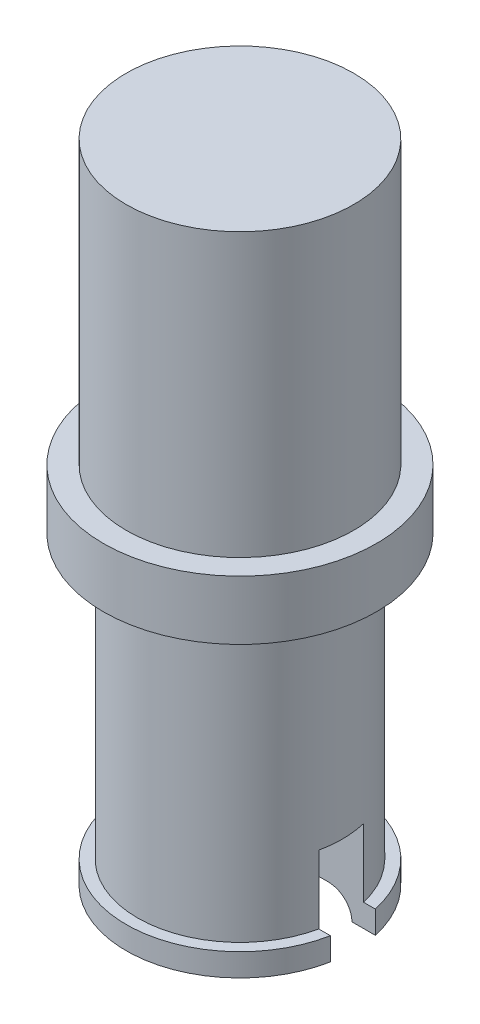
ISO-10303-21;
HEADER;
FILE_DESCRIPTION(('STEP AP214'),'2;1');
FILE_NAME('part.step','',(''),(''),'','','');
FILE_SCHEMA(('AUTOMOTIVE_DESIGN { 1 0 10303 214 1 1 1 1 }'));
ENDSEC;
DATA;
#1=APPLICATION_CONTEXT('core data for automotive mechanical design processes');
#2=APPLICATION_PROTOCOL_DEFINITION('international standard','automotive_design',2000,#1);
#3=PRODUCT_CONTEXT('',#1,'mechanical');
#4=PRODUCT('Part','Part','',(#3));
#5=PRODUCT_RELATED_PRODUCT_CATEGORY('part','',(#4));
#6=PRODUCT_DEFINITION_FORMATION('','',#4);
#7=PRODUCT_DEFINITION_CONTEXT('part definition',#1,'design');
#8=PRODUCT_DEFINITION('design','',#6,#7);
#9=PRODUCT_DEFINITION_SHAPE('','',#8);
#10=(LENGTH_UNIT() NAMED_UNIT(*) SI_UNIT(.MILLI.,.METRE.));
#11=(NAMED_UNIT(*) PLANE_ANGLE_UNIT() SI_UNIT($,.RADIAN.));
#12=(NAMED_UNIT(*) SI_UNIT($,.STERADIAN.) SOLID_ANGLE_UNIT());
#13=UNCERTAINTY_MEASURE_WITH_UNIT(LENGTH_MEASURE(1.E-05),#10,'distance_accuracy_value','');
#14=(GEOMETRIC_REPRESENTATION_CONTEXT(3) GLOBAL_UNCERTAINTY_ASSIGNED_CONTEXT((#13)) GLOBAL_UNIT_ASSIGNED_CONTEXT((#10,
#11,#12)) REPRESENTATION_CONTEXT('',''));
#15=CARTESIAN_POINT('',(0.,0.,0.));
#16=DIRECTION('',(0.,0.,1.));
#17=DIRECTION('',(1.,0.,0.));
#18=AXIS2_PLACEMENT_3D('',#15,#16,#17);
#19=CARTESIAN_POINT('',(0.,0.5,0.));
#20=DIRECTION('',(0.,1.,0.));
#21=DIRECTION('',(0.,0.,1.));
#22=AXIS2_PLACEMENT_3D('',#19,#20,#21);
#23=PLANE('',#22);
#24=DIRECTION('',(1.,0.,0.));
#25=VECTOR('',#24,1.);
#26=CARTESIAN_POINT('',(0.,0.5,0.468491026025954));
#27=LINE('',#26,#25);
#28=CARTESIAN_POINT('',(-2.45571092731477,0.5,0.468491026025954));
#29=VERTEX_POINT('',#28);
#30=CARTESIAN_POINT('',(-2.20068538381413,0.5,0.468491026025954));
#31=VERTEX_POINT('',#30);
#32=EDGE_CURVE('E186',#29,#31,#27,.T.);
#33=ORIENTED_EDGE('',*,*,#32,.F.);
#34=CARTESIAN_POINT('',(0.,0.5,0.));
#35=DIRECTION('',(0.,1.,0.));
#36=DIRECTION('',(0.,0.,1.));
#37=AXIS2_PLACEMENT_3D('',#34,#35,#36);
#38=CIRCLE('',#37,2.5);
#39=CARTESIAN_POINT('',(2.45571092731477,0.5,0.468491026025954));
#40=VERTEX_POINT('',#39);
#41=EDGE_CURVE('E228',#29,#40,#38,.T.);
#42=ORIENTED_EDGE('',*,*,#41,.T.);
#43=CARTESIAN_POINT('',(2.20068538381413,0.5,0.468491026025954));
#44=VERTEX_POINT('',#43);
#45=EDGE_CURVE('E181',#44,#40,#27,.T.);
#46=ORIENTED_EDGE('',*,*,#45,.F.);
#47=CARTESIAN_POINT('',(0.,0.5,0.));
#48=DIRECTION('',(0.,1.,0.));
#49=DIRECTION('',(0.,0.,1.));
#50=AXIS2_PLACEMENT_3D('',#47,#48,#49);
#51=CIRCLE('',#50,2.25);
#52=EDGE_CURVE('E180',#31,#44,#51,.T.);
#53=ORIENTED_EDGE('',*,*,#52,.F.);
#54=EDGE_LOOP('',(#33,#42,#46,#53));
#55=FACE_BOUND('',#54,.T.);
#56=ADVANCED_FACE('F35',(#55),#23,.T.);
#57=CARTESIAN_POINT('',(0.,0.,0.));
#58=DIRECTION('',(0.,1.,0.));
#59=DIRECTION('',(0.,0.,1.));
#60=AXIS2_PLACEMENT_3D('',#57,#58,#59);
#61=PLANE('',#60);
#62=CARTESIAN_POINT('',(0.,0.,0.));
#63=DIRECTION('',(0.,1.,0.));
#64=DIRECTION('',(0.,0.,1.));
#65=AXIS2_PLACEMENT_3D('',#62,#63,#64);
#66=CIRCLE('',#65,2.5);
#67=CARTESIAN_POINT('',(-2.45571092731477,0.,0.468491026025954));
#68=VERTEX_POINT('',#67);
#69=CARTESIAN_POINT('',(2.45571092731477,0.,0.468491026025954));
#70=VERTEX_POINT('',#69);
#71=EDGE_CURVE('E232',#68,#70,#66,.T.);
#72=ORIENTED_EDGE('',*,*,#71,.F.);
#73=DIRECTION('',(-1.,0.,0.));
#74=VECTOR('',#73,1.);
#75=CARTESIAN_POINT('',(-2.60754158019278,0.,0.468491026025954));
#76=LINE('',#75,#74);
#77=CARTESIAN_POINT('',(-1.9443549466425,0.,0.468491026025954));
#78=VERTEX_POINT('',#77);
#79=EDGE_CURVE('E331',#78,#68,#76,.T.);
#80=ORIENTED_EDGE('',*,*,#79,.F.);
#81=CARTESIAN_POINT('',(0.,0.,0.));
#82=DIRECTION('',(0.,1.,0.));
#83=DIRECTION('',(0.,0.,1.));
#84=AXIS2_PLACEMENT_3D('',#81,#82,#83);
#85=CIRCLE('',#84,2.);
#86=CARTESIAN_POINT('',(1.9443549466425,0.,0.468491026025954));
#87=VERTEX_POINT('',#86);
#88=EDGE_CURVE('E222',#78,#87,#85,.T.);
#89=ORIENTED_EDGE('',*,*,#88,.T.);
#90=EDGE_CURVE('E337',#70,#87,#76,.T.);
#91=ORIENTED_EDGE('',*,*,#90,.F.);
#92=EDGE_LOOP('',(#72,#80,#89,#91));
#93=FACE_BOUND('',#92,.T.);
#94=ADVANCED_FACE('F283',(#93),#61,.F.);
#95=CARTESIAN_POINT('',(0.,0.5,0.));
#96=DIRECTION('',(0.,-1.,0.));
#97=DIRECTION('',(0.,0.,-1.));
#98=AXIS2_PLACEMENT_3D('',#95,#96,#97);
#99=CYLINDRICAL_SURFACE('',#98,2.5);
#100=ORIENTED_EDGE('',*,*,#41,.F.);
#101=DIRECTION('',(0.,-1.,0.));
#102=VECTOR('',#101,1.);
#103=CARTESIAN_POINT('',(-2.45571092731477,0.5,0.468491026025954));
#104=LINE('',#103,#102);
#105=EDGE_CURVE('E195',#29,#68,#104,.T.);
#106=ORIENTED_EDGE('',*,*,#105,.T.);
#107=ORIENTED_EDGE('',*,*,#71,.T.);
#108=DIRECTION('',(0.,-1.,0.));
#109=VECTOR('',#108,1.);
#110=CARTESIAN_POINT('',(2.45571092731477,0.5,0.468491026025954));
#111=LINE('',#110,#109);
#112=EDGE_CURVE('E184',#70,#40,#111,.F.);
#113=ORIENTED_EDGE('',*,*,#112,.T.);
#114=EDGE_LOOP('',(#100,#106,#107,#113));
#115=FACE_BOUND('',#114,.T.);
#116=ADVANCED_FACE('F278',(#115),#99,.T.);
#117=CARTESIAN_POINT('',(0.,0.5,0.));
#118=DIRECTION('',(0.,1.,0.));
#119=DIRECTION('',(0.,0.,1.));
#120=AXIS2_PLACEMENT_3D('',#117,#118,#119);
#121=PLANE('',#120);
#122=DIRECTION('',(1.,0.,0.));
#123=VECTOR('',#122,1.);
#124=CARTESIAN_POINT('',(0.,0.5,0.468491026025954));
#125=LINE('',#124,#123);
#126=CARTESIAN_POINT('',(1.15888574006808,0.5,0.468491026025954));
#127=VERTEX_POINT('',#126);
#128=CARTESIAN_POINT('',(1.42496180949987,0.5,0.468491026025954));
#129=VERTEX_POINT('',#128);
#130=EDGE_CURVE('E187',#127,#129,#125,.T.);
#131=ORIENTED_EDGE('',*,*,#130,.T.);
#132=CARTESIAN_POINT('',(0.,0.5,0.));
#133=DIRECTION('',(0.,1.,0.));
#134=DIRECTION('',(0.,0.,1.));
#135=AXIS2_PLACEMENT_3D('',#132,#133,#134);
#136=CIRCLE('',#135,1.5);
#137=CARTESIAN_POINT('',(-1.42496180949987,0.5,0.468491026025954));
#138=VERTEX_POINT('',#137);
#139=EDGE_CURVE('E248',#129,#138,#136,.F.);
#140=ORIENTED_EDGE('',*,*,#139,.T.);
#141=CARTESIAN_POINT('',(-1.15888574006808,0.5,0.468491026025954));
#142=VERTEX_POINT('',#141);
#143=EDGE_CURVE('E182',#138,#142,#125,.T.);
#144=ORIENTED_EDGE('',*,*,#143,.T.);
#145=CARTESIAN_POINT('',(0.,0.5,0.));
#146=DIRECTION('',(0.,1.,0.));
#147=DIRECTION('',(0.,0.,1.));
#148=AXIS2_PLACEMENT_3D('',#145,#146,#147);
#149=CIRCLE('',#148,1.25);
#150=EDGE_CURVE('E215',#142,#127,#149,.T.);
#151=ORIENTED_EDGE('',*,*,#150,.T.);
#152=EDGE_LOOP('',(#131,#140,#144,#151));
#153=FACE_BOUND('',#152,.T.);
#154=ADVANCED_FACE('F286',(#153),#121,.F.);
#155=DIRECTION('',(-1.,0.,0.));
#156=VECTOR('',#155,1.);
#157=CARTESIAN_POINT('',(0.,0.5,-0.531508973974046));
#158=LINE('',#157,#156);
#159=CARTESIAN_POINT('',(2.44284633380511,0.5,-0.531508973974046));
#160=VERTEX_POINT('',#159);
#161=CARTESIAN_POINT('',(2.18632070167783,0.5,-0.531508973974046));
#162=VERTEX_POINT('',#161);
#163=EDGE_CURVE('E354',#160,#162,#158,.T.);
#164=ORIENTED_EDGE('',*,*,#163,.F.);
#165=CARTESIAN_POINT('',(-2.44284633380511,0.5,-0.531508973974047));
#166=VERTEX_POINT('',#165);
#167=EDGE_CURVE('E206',#160,#166,#38,.T.);
#168=ORIENTED_EDGE('',*,*,#167,.T.);
#169=CARTESIAN_POINT('',(-2.18632070167783,0.5,-0.531508973974046));
#170=VERTEX_POINT('',#169);
#171=EDGE_CURVE('E351',#170,#166,#158,.T.);
#172=ORIENTED_EDGE('',*,*,#171,.F.);
#173=EDGE_CURVE('E223',#162,#170,#51,.T.);
#174=ORIENTED_EDGE('',*,*,#173,.F.);
#175=EDGE_LOOP('',(#164,#168,#172,#174));
#176=FACE_BOUND('',#175,.T.);
#177=ADVANCED_FACE('F281',(#176),#23,.T.);
#178=CARTESIAN_POINT('',(2.44284633380511,0.,-0.531508973974046));
#179=VERTEX_POINT('',#178);
#180=CARTESIAN_POINT('',(-2.44284633380511,0.,-0.531508973974047));
#181=VERTEX_POINT('',#180);
#182=EDGE_CURVE('E231',#179,#181,#66,.T.);
#183=ORIENTED_EDGE('',*,*,#182,.F.);
#184=DIRECTION('',(1.,0.,0.));
#185=VECTOR('',#184,1.);
#186=CARTESIAN_POINT('',(-2.60754158019278,0.,-0.531508973974047));
#187=LINE('',#186,#185);
#188=CARTESIAN_POINT('',(1.92808148442566,0.,-0.531508973974046));
#189=VERTEX_POINT('',#188);
#190=EDGE_CURVE('E344',#189,#179,#187,.T.);
#191=ORIENTED_EDGE('',*,*,#190,.F.);
#192=CARTESIAN_POINT('',(-1.92808148442566,0.,-0.531508973974046));
#193=VERTEX_POINT('',#192);
#194=EDGE_CURVE('E227',#189,#193,#85,.T.);
#195=ORIENTED_EDGE('',*,*,#194,.T.);
#196=EDGE_CURVE('E338',#181,#193,#187,.T.);
#197=ORIENTED_EDGE('',*,*,#196,.F.);
#198=EDGE_LOOP('',(#183,#191,#195,#197));
#199=FACE_BOUND('',#198,.T.);
#200=ADVANCED_FACE('F276',(#199),#61,.F.);
#201=ORIENTED_EDGE('',*,*,#167,.F.);
#202=DIRECTION('',(0.,-1.,0.));
#203=VECTOR('',#202,1.);
#204=CARTESIAN_POINT('',(2.44284633380511,0.5,-0.531508973974046));
#205=LINE('',#204,#203);
#206=EDGE_CURVE('E358',#160,#179,#205,.T.);
#207=ORIENTED_EDGE('',*,*,#206,.T.);
#208=ORIENTED_EDGE('',*,*,#182,.T.);
#209=DIRECTION('',(0.,-1.,0.));
#210=VECTOR('',#209,1.);
#211=CARTESIAN_POINT('',(-2.44284633380511,0.5,-0.531508973974047));
#212=LINE('',#211,#210);
#213=EDGE_CURVE('E353',#181,#166,#212,.F.);
#214=ORIENTED_EDGE('',*,*,#213,.T.);
#215=EDGE_LOOP('',(#201,#207,#208,#214));
#216=FACE_BOUND('',#215,.T.);
#217=ADVANCED_FACE('F271',(#216),#99,.T.);
#218=DIRECTION('',(-1.,0.,0.));
#219=VECTOR('',#218,1.);
#220=CARTESIAN_POINT('',(0.,0.5,-0.531508973974046));
#221=LINE('',#220,#219);
#222=CARTESIAN_POINT('',(-1.13137005908105,0.5,-0.531508973974046));
#223=VERTEX_POINT('',#222);
#224=CARTESIAN_POINT('',(-1.40267537605287,0.5,-0.531508973974046));
#225=VERTEX_POINT('',#224);
#226=EDGE_CURVE('E162',#223,#225,#221,.T.);
#227=ORIENTED_EDGE('',*,*,#226,.T.);
#228=CARTESIAN_POINT('',(0.,0.5,0.));
#229=DIRECTION('',(0.,1.,0.));
#230=DIRECTION('',(0.,0.,1.));
#231=AXIS2_PLACEMENT_3D('',#228,#229,#230);
#232=CIRCLE('',#231,1.5);
#233=CARTESIAN_POINT('',(1.40267537605287,0.5,-0.531508973974046));
#234=VERTEX_POINT('',#233);
#235=EDGE_CURVE('E62',#225,#234,#232,.F.);
#236=ORIENTED_EDGE('',*,*,#235,.T.);
#237=CARTESIAN_POINT('',(1.13137005908105,0.5,-0.531508973974046));
#238=VERTEX_POINT('',#237);
#239=EDGE_CURVE('E347',#234,#238,#221,.T.);
#240=ORIENTED_EDGE('',*,*,#239,.T.);
#241=EDGE_CURVE('E218',#238,#223,#149,.T.);
#242=ORIENTED_EDGE('',*,*,#241,.T.);
#243=EDGE_LOOP('',(#227,#236,#240,#242));
#244=FACE_BOUND('',#243,.T.);
#245=ADVANCED_FACE('F275',(#244),#121,.F.);
#246=CARTESIAN_POINT('',(0.,6.7,0.));
#247=DIRECTION('',(0.,-1.,0.));
#248=DIRECTION('',(0.,0.,-1.));
#249=AXIS2_PLACEMENT_3D('',#246,#247,#248);
#250=CYLINDRICAL_SURFACE('',#249,2.25);
#251=ORIENTED_EDGE('',*,*,#52,.T.);
#252=DIRECTION('',(0.,-1.,0.));
#253=VECTOR('',#252,1.);
#254=CARTESIAN_POINT('',(2.20068538381413,6.7,0.468491026025954));
#255=LINE('',#254,#253);
#256=CARTESIAN_POINT('',(2.20068538381413,2.,0.468491026025954));
#257=VERTEX_POINT('',#256);
#258=EDGE_CURVE('E168',#44,#257,#255,.F.);
#259=ORIENTED_EDGE('',*,*,#258,.T.);
#260=CARTESIAN_POINT('',(0.,2.,0.));
#261=DIRECTION('',(0.,-1.,0.));
#262=DIRECTION('',(0.,0.,-1.));
#263=AXIS2_PLACEMENT_3D('',#260,#261,#262);
#264=CIRCLE('',#263,2.25);
#265=CARTESIAN_POINT('',(2.18632070167783,2.,-0.531508973974046));
#266=VERTEX_POINT('',#265);
#267=EDGE_CURVE('E152',#266,#257,#264,.T.);
#268=ORIENTED_EDGE('',*,*,#267,.F.);
#269=DIRECTION('',(0.,-1.,0.));
#270=VECTOR('',#269,1.);
#271=CARTESIAN_POINT('',(2.18632070167783,6.7,-0.531508973974046));
#272=LINE('',#271,#270);
#273=EDGE_CURVE('E357',#266,#162,#272,.T.);
#274=ORIENTED_EDGE('',*,*,#273,.T.);
#275=ORIENTED_EDGE('',*,*,#173,.T.);
#276=DIRECTION('',(0.,-1.,0.));
#277=VECTOR('',#276,1.);
#278=CARTESIAN_POINT('',(-2.18632070167783,6.7,-0.531508973974046));
#279=LINE('',#278,#277);
#280=CARTESIAN_POINT('',(-2.18632070167783,2.,-0.531508973974046));
#281=VERTEX_POINT('',#280);
#282=EDGE_CURVE('E348',#170,#281,#279,.F.);
#283=ORIENTED_EDGE('',*,*,#282,.T.);
#284=CARTESIAN_POINT('',(-2.20068538381413,2.,0.468491026025954));
#285=VERTEX_POINT('',#284);
#286=EDGE_CURVE('E163',#285,#281,#264,.T.);
#287=ORIENTED_EDGE('',*,*,#286,.F.);
#288=DIRECTION('',(0.,-1.,0.));
#289=VECTOR('',#288,1.);
#290=CARTESIAN_POINT('',(-2.20068538381413,6.7,0.468491026025954));
#291=LINE('',#290,#289);
#292=EDGE_CURVE('E193',#285,#31,#291,.T.);
#293=ORIENTED_EDGE('',*,*,#292,.T.);
#294=EDGE_LOOP('',(#251,#259,#268,#274,#275,#283,#287,#293));
#295=FACE_BOUND('',#294,.T.);
#296=CARTESIAN_POINT('',(0.,6.7,0.));
#297=DIRECTION('',(0.,1.,0.));
#298=DIRECTION('',(0.,0.,1.));
#299=AXIS2_PLACEMENT_3D('',#296,#297,#298);
#300=CIRCLE('',#299,2.25);
#301=CARTESIAN_POINT('',(0.,6.7,2.25));
#302=VERTEX_POINT('',#301);
#303=EDGE_CURVE('E219',#302,#302,#300,.T.);
#304=ORIENTED_EDGE('',*,*,#303,.F.);
#305=EDGE_LOOP('',(#304));
#306=FACE_BOUND('',#305,.T.);
#307=ADVANCED_FACE('F176',(#295,#306),#250,.T.);
#308=CARTESIAN_POINT('',(0.,6.7,0.));
#309=DIRECTION('',(0.,-1.,0.));
#310=DIRECTION('',(0.,0.,-1.));
#311=AXIS2_PLACEMENT_3D('',#308,#309,#310);
#312=CYLINDRICAL_SURFACE('',#311,1.25);
#313=DIRECTION('',(0.,-1.,0.));
#314=VECTOR('',#313,1.);
#315=CARTESIAN_POINT('',(1.15888574006808,6.7,0.468491026025954));
#316=LINE('',#315,#314);
#317=CARTESIAN_POINT('',(1.15888574006808,2.,0.468491026025954));
#318=VERTEX_POINT('',#317);
#319=EDGE_CURVE('E171',#127,#318,#316,.F.);
#320=ORIENTED_EDGE('',*,*,#319,.F.);
#321=ORIENTED_EDGE('',*,*,#150,.F.);
#322=DIRECTION('',(0.,-1.,0.));
#323=VECTOR('',#322,1.);
#324=CARTESIAN_POINT('',(-1.15888574006808,6.7,0.468491026025954));
#325=LINE('',#324,#323);
#326=CARTESIAN_POINT('',(-1.15888574006808,2.,0.468491026025954));
#327=VERTEX_POINT('',#326);
#328=EDGE_CURVE('E241',#327,#142,#325,.T.);
#329=ORIENTED_EDGE('',*,*,#328,.F.);
#330=CARTESIAN_POINT('',(0.,2.,0.));
#331=DIRECTION('',(0.,-1.,0.));
#332=DIRECTION('',(0.,0.,-1.));
#333=AXIS2_PLACEMENT_3D('',#330,#331,#332);
#334=CIRCLE('',#333,1.25);
#335=CARTESIAN_POINT('',(-1.13137005908105,2.,-0.531508973974046));
#336=VERTEX_POINT('',#335);
#337=EDGE_CURVE('E205',#327,#336,#334,.T.);
#338=ORIENTED_EDGE('',*,*,#337,.T.);
#339=DIRECTION('',(0.,-1.,0.));
#340=VECTOR('',#339,1.);
#341=CARTESIAN_POINT('',(-1.13137005908105,6.7,-0.531508973974046));
#342=LINE('',#341,#340);
#343=EDGE_CURVE('E237',#223,#336,#342,.F.);
#344=ORIENTED_EDGE('',*,*,#343,.F.);
#345=ORIENTED_EDGE('',*,*,#241,.F.);
#346=DIRECTION('',(0.,-1.,0.));
#347=VECTOR('',#346,1.);
#348=CARTESIAN_POINT('',(1.13137005908105,6.7,-0.531508973974046));
#349=LINE('',#348,#347);
#350=CARTESIAN_POINT('',(1.13137005908105,2.,-0.531508973974046));
#351=VERTEX_POINT('',#350);
#352=EDGE_CURVE('E244',#351,#238,#349,.T.);
#353=ORIENTED_EDGE('',*,*,#352,.F.);
#354=EDGE_CURVE('E238',#351,#318,#334,.T.);
#355=ORIENTED_EDGE('',*,*,#354,.T.);
#356=EDGE_LOOP('',(#320,#321,#329,#338,#344,#345,#353,#355));
#357=FACE_BOUND('',#356,.T.);
#358=CARTESIAN_POINT('',(0.,6.7,0.));
#359=DIRECTION('',(0.,1.,0.));
#360=DIRECTION('',(0.,0.,1.));
#361=AXIS2_PLACEMENT_3D('',#358,#359,#360);
#362=CIRCLE('',#361,1.25);
#363=CARTESIAN_POINT('',(0.,6.7,1.25));
#364=VERTEX_POINT('',#363);
#365=EDGE_CURVE('E210',#364,#364,#362,.T.);
#366=ORIENTED_EDGE('',*,*,#365,.T.);
#367=EDGE_LOOP('',(#366));
#368=FACE_BOUND('',#367,.T.);
#369=ADVANCED_FACE('F290',(#357,#368),#312,.F.);
#370=CARTESIAN_POINT('',(0.,6.7,0.));
#371=DIRECTION('',(0.,1.,0.));
#372=DIRECTION('',(0.,0.,1.));
#373=AXIS2_PLACEMENT_3D('',#370,#371,#372);
#374=PLANE('',#373);
#375=ORIENTED_EDGE('',*,*,#365,.F.);
#376=EDGE_LOOP('',(#375));
#377=FACE_BOUND('',#376,.T.);
#378=ADVANCED_FACE('F295',(#377),#374,.F.);
#379=CARTESIAN_POINT('',(0.,8.,0.));
#380=DIRECTION('',(0.,-1.,0.));
#381=DIRECTION('',(0.,0.,-1.));
#382=AXIS2_PLACEMENT_3D('',#379,#380,#381);
#383=CYLINDRICAL_SURFACE('',#382,3.);
#384=CARTESIAN_POINT('',(0.,8.,0.));
#385=DIRECTION('',(0.,1.,0.));
#386=DIRECTION('',(0.,0.,1.));
#387=AXIS2_PLACEMENT_3D('',#384,#385,#386);
#388=CIRCLE('',#387,3.);
#389=CARTESIAN_POINT('',(0.,8.,3.));
#390=VERTEX_POINT('',#389);
#391=EDGE_CURVE('E207',#390,#390,#388,.T.);
#392=ORIENTED_EDGE('',*,*,#391,.F.);
#393=EDGE_LOOP('',(#392));
#394=FACE_BOUND('',#393,.T.);
#395=CARTESIAN_POINT('',(0.,6.7,0.));
#396=DIRECTION('',(0.,1.,0.));
#397=DIRECTION('',(0.,0.,1.));
#398=AXIS2_PLACEMENT_3D('',#395,#396,#397);
#399=CIRCLE('',#398,3.);
#400=CARTESIAN_POINT('',(0.,6.7,3.));
#401=VERTEX_POINT('',#400);
#402=EDGE_CURVE('E201',#401,#401,#399,.T.);
#403=ORIENTED_EDGE('',*,*,#402,.T.);
#404=EDGE_LOOP('',(#403));
#405=FACE_BOUND('',#404,.T.);
#406=ADVANCED_FACE('F297',(#394,#405),#383,.T.);
#407=CARTESIAN_POINT('',(0.,8.,0.));
#408=DIRECTION('',(0.,1.,0.));
#409=DIRECTION('',(0.,0.,1.));
#410=AXIS2_PLACEMENT_3D('',#407,#408,#409);
#411=PLANE('',#410);
#412=CARTESIAN_POINT('',(0.,8.,0.));
#413=DIRECTION('',(0.,1.,0.));
#414=DIRECTION('',(0.,0.,1.));
#415=AXIS2_PLACEMENT_3D('',#412,#413,#414);
#416=CIRCLE('',#415,2.5);
#417=CARTESIAN_POINT('',(0.,8.,-2.5));
#418=VERTEX_POINT('',#417);
#419=EDGE_CURVE('E202',#418,#418,#416,.T.);
#420=ORIENTED_EDGE('',*,*,#419,.F.);
#421=EDGE_LOOP('',(#420));
#422=FACE_BOUND('',#421,.T.);
#423=ORIENTED_EDGE('',*,*,#391,.T.);
#424=EDGE_LOOP('',(#423));
#425=FACE_BOUND('',#424,.T.);
#426=ADVANCED_FACE('F300',(#422,#425),#411,.T.);
#427=ORIENTED_EDGE('',*,*,#303,.T.);
#428=EDGE_LOOP('',(#427));
#429=FACE_BOUND('',#428,.T.);
#430=ORIENTED_EDGE('',*,*,#402,.F.);
#431=EDGE_LOOP('',(#430));
#432=FACE_BOUND('',#431,.T.);
#433=ADVANCED_FACE('F302',(#429,#432),#374,.F.);
#434=CARTESIAN_POINT('',(0.,14.2,0.));
#435=DIRECTION('',(0.,-1.,0.));
#436=DIRECTION('',(0.,0.,-1.));
#437=AXIS2_PLACEMENT_3D('',#434,#435,#436);
#438=CYLINDRICAL_SURFACE('',#437,2.5);
#439=CARTESIAN_POINT('',(0.,14.2,0.));
#440=DIRECTION('',(0.,1.,0.));
#441=DIRECTION('',(0.,0.,1.));
#442=AXIS2_PLACEMENT_3D('',#439,#440,#441);
#443=CIRCLE('',#442,2.5);
#444=CARTESIAN_POINT('',(0.,14.2,-2.5));
#445=VERTEX_POINT('',#444);
#446=EDGE_CURVE('E198',#445,#445,#443,.T.);
#447=CARTESIAN_POINT('',(0.,14.2,-2.5));
#448=CARTESIAN_POINT('',(0.,14.1354166666667,-2.5));
#449=CARTESIAN_POINT('',(0.,14.0708333333333,-2.5));
#450=CARTESIAN_POINT('',(0.,13.9416666666667,-2.5));
#451=CARTESIAN_POINT('',(0.,13.8770833333333,-2.5));
#452=CARTESIAN_POINT('',(0.,13.7479166666667,-2.5));
#453=CARTESIAN_POINT('',(0.,13.6833333333333,-2.5));
#454=CARTESIAN_POINT('',(0.,13.5541666666667,-2.5));
#455=CARTESIAN_POINT('',(0.,13.4895833333333,-2.5));
#456=CARTESIAN_POINT('',(0.,13.3604166666667,-2.5));
#457=CARTESIAN_POINT('',(0.,13.2958333333333,-2.5));
#458=CARTESIAN_POINT('',(0.,13.1666666666667,-2.5));
#459=CARTESIAN_POINT('',(0.,13.1020833333333,-2.5));
#460=CARTESIAN_POINT('',(0.,12.9729166666667,-2.5));
#461=CARTESIAN_POINT('',(0.,12.9083333333333,-2.5));
#462=CARTESIAN_POINT('',(0.,12.7791666666667,-2.5));
#463=CARTESIAN_POINT('',(0.,12.7145833333333,-2.5));
#464=CARTESIAN_POINT('',(0.,12.5854166666667,-2.5));
#465=CARTESIAN_POINT('',(0.,12.5208333333333,-2.5));
#466=CARTESIAN_POINT('',(0.,12.3916666666667,-2.5));
#467=CARTESIAN_POINT('',(0.,12.3270833333333,-2.5));
#468=CARTESIAN_POINT('',(0.,12.1979166666667,-2.5));
#469=CARTESIAN_POINT('',(0.,12.1333333333333,-2.5));
#470=CARTESIAN_POINT('',(0.,12.0041666666667,-2.5));
#471=CARTESIAN_POINT('',(0.,11.9395833333333,-2.5));
#472=CARTESIAN_POINT('',(0.,11.8104166666667,-2.5));
#473=CARTESIAN_POINT('',(0.,11.7458333333333,-2.5));
#474=CARTESIAN_POINT('',(0.,11.6166666666667,-2.5));
#475=CARTESIAN_POINT('',(0.,11.5520833333333,-2.5));
#476=CARTESIAN_POINT('',(0.,11.4229166666667,-2.5));
#477=CARTESIAN_POINT('',(0.,11.3583333333333,-2.5));
#478=CARTESIAN_POINT('',(0.,11.2291666666667,-2.5));
#479=CARTESIAN_POINT('',(0.,11.1645833333333,-2.5));
#480=CARTESIAN_POINT('',(0.,11.0354166666667,-2.5));
#481=CARTESIAN_POINT('',(0.,10.9708333333333,-2.5));
#482=CARTESIAN_POINT('',(0.,10.8416666666667,-2.5));
#483=CARTESIAN_POINT('',(0.,10.7770833333333,-2.5));
#484=CARTESIAN_POINT('',(0.,10.6479166666667,-2.5));
#485=CARTESIAN_POINT('',(0.,10.5833333333333,-2.5));
#486=CARTESIAN_POINT('',(0.,10.4541666666667,-2.5));
#487=CARTESIAN_POINT('',(0.,10.3895833333333,-2.5));
#488=CARTESIAN_POINT('',(0.,10.2604166666667,-2.5));
#489=CARTESIAN_POINT('',(0.,10.1958333333333,-2.5));
#490=CARTESIAN_POINT('',(0.,10.0666666666667,-2.5));
#491=CARTESIAN_POINT('',(0.,10.0020833333333,-2.5));
#492=CARTESIAN_POINT('',(0.,9.87291666666667,-2.5));
#493=CARTESIAN_POINT('',(0.,9.80833333333333,-2.5));
#494=CARTESIAN_POINT('',(0.,9.67916666666667,-2.5));
#495=CARTESIAN_POINT('',(0.,9.61458333333333,-2.5));
#496=CARTESIAN_POINT('',(0.,9.48541666666667,-2.5));
#497=CARTESIAN_POINT('',(0.,9.42083333333333,-2.5));
#498=CARTESIAN_POINT('',(0.,9.29166666666667,-2.5));
#499=CARTESIAN_POINT('',(0.,9.22708333333333,-2.5));
#500=CARTESIAN_POINT('',(0.,9.09791666666667,-2.5));
#501=CARTESIAN_POINT('',(0.,9.03333333333333,-2.5));
#502=CARTESIAN_POINT('',(0.,8.90416666666667,-2.5));
#503=CARTESIAN_POINT('',(0.,8.83958333333333,-2.5));
#504=CARTESIAN_POINT('',(0.,8.71041666666667,-2.5));
#505=CARTESIAN_POINT('',(0.,8.64583333333333,-2.5));
#506=CARTESIAN_POINT('',(0.,8.51666666666667,-2.5));
#507=CARTESIAN_POINT('',(0.,8.45208333333333,-2.5));
#508=CARTESIAN_POINT('',(0.,8.32291666666667,-2.5));
#509=CARTESIAN_POINT('',(0.,8.25833333333333,-2.5));
#510=CARTESIAN_POINT('',(0.,8.12916666666667,-2.5));
#511=CARTESIAN_POINT('',(0.,8.06458333333333,-2.5));
#512=CARTESIAN_POINT('',(0.,8.,-2.5));
#513=B_SPLINE_CURVE_WITH_KNOTS('',3,(#447,#448,#449,#450,#451,#452,#453,#454,#455,#456,#457,
#458,#459,#460,#461,#462,#463,#464,#465,#466,#467,#468,#469,#470,#471,#472,#473,#474,#475,#476,
#477,#478,#479,#480,#481,#482,#483,#484,#485,#486,#487,#488,#489,#490,#491,#492,#493,#494,#495,
#496,#497,#498,#499,#500,#501,#502,#503,#504,#505,#506,#507,#508,#509,#510,#511,#512),
.UNSPECIFIED.,.F.,.F.,(4,2,2,2,2,2,2,2,2,2,2,2,2,2,2,2,2,2,2,2,2,2,2,2,2,2,2,2,2,2,2,2,4),(0.,
0.193750000000001,0.387500000000001,0.58125,0.775000000000001,0.968750000000001,1.1625,1.35625,
1.55,1.74375,1.9375,2.13125,2.325,2.51875,2.7125,2.90625,3.1,3.29375,3.4875,3.68125,3.875,
4.06875,4.2625,4.45625,4.65,4.84375,5.0375,5.23125,5.425,5.61875,5.8125,6.00625,6.2),.UNSPECIFIED.);
#514=EDGE_CURVE('BSEAM305',#445,#418,#513,.T.);
#515=ORIENTED_EDGE('',*,*,#446,.F.);
#516=ORIENTED_EDGE('',*,*,#419,.T.);
#517=ORIENTED_EDGE('',*,*,#514,.T.);
#518=ORIENTED_EDGE('',*,*,#514,.F.);
#519=EDGE_LOOP('',(#515,#517,#516,#518));
#520=FACE_BOUND('',#519,.T.);
#521=ADVANCED_FACE('F305',(#520),#438,.T.);
#522=CARTESIAN_POINT('',(0.,14.2,0.));
#523=DIRECTION('',(0.,1.,0.));
#524=DIRECTION('',(0.,0.,1.));
#525=AXIS2_PLACEMENT_3D('',#522,#523,#524);
#526=PLANE('',#525);
#527=ORIENTED_EDGE('',*,*,#446,.T.);
#528=EDGE_LOOP('',(#527));
#529=FACE_BOUND('',#528,.T.);
#530=ADVANCED_FACE('F312',(#529),#526,.T.);
#531=CARTESIAN_POINT('',(0.,2.,0.));
#532=DIRECTION('',(0.,-1.,0.));
#533=DIRECTION('',(0.,0.,-1.));
#534=AXIS2_PLACEMENT_3D('',#531,#532,#533);
#535=PLANE('',#534);
#536=ORIENTED_EDGE('',*,*,#286,.T.);
#537=DIRECTION('',(1.,0.,0.));
#538=VECTOR('',#537,1.);
#539=CARTESIAN_POINT('',(-2.60754158019278,2.,-0.531508973974047));
#540=LINE('',#539,#538);
#541=EDGE_CURVE('E341',#281,#336,#540,.T.);
#542=ORIENTED_EDGE('',*,*,#541,.T.);
#543=ORIENTED_EDGE('',*,*,#337,.F.);
#544=DIRECTION('',(-1.,0.,0.));
#545=VECTOR('',#544,1.);
#546=CARTESIAN_POINT('',(-2.60754158019278,2.,0.468491026025954));
#547=LINE('',#546,#545);
#548=EDGE_CURVE('E173',#327,#285,#547,.T.);
#549=ORIENTED_EDGE('',*,*,#548,.T.);
#550=EDGE_LOOP('',(#536,#542,#543,#549));
#551=FACE_BOUND('',#550,.T.);
#552=ADVANCED_FACE('F315',(#551),#535,.T.);
#553=CARTESIAN_POINT('',(-2.60754158019278,2.,-0.531508973974047));
#554=DIRECTION('',(0.,0.,-1.));
#555=DIRECTION('',(-1.,0.,0.));
#556=AXIS2_PLACEMENT_3D('',#553,#554,#555);
#557=PLANE('',#556);
#558=ORIENTED_EDGE('',*,*,#196,.T.);
#559=CARTESIAN_POINT('',(-1.92808148442566,0.,-0.531508973974046));
#560=CARTESIAN_POINT('',(-1.92810846503036,0.0273405945377121,-0.531508973974046));
#561=CARTESIAN_POINT('',(-1.9257571008177,0.0546695634656118,-0.531508973974046));
#562=CARTESIAN_POINT('',(-1.91650202054064,0.108501315133308,-0.531508973974046));
#563=CARTESIAN_POINT('',(-1.90960574456824,0.13500537412999,-0.531508973974046));
#564=CARTESIAN_POINT('',(-1.89146208423215,0.186483965153839,-0.531508973974046));
#565=CARTESIAN_POINT('',(-1.88021379523048,0.211458177926102,-0.531508973974046));
#566=CARTESIAN_POINT('',(-1.85373646164205,0.259195898413379,-0.531508973974046));
#567=CARTESIAN_POINT('',(-1.83850716967974,0.281959268628241,-0.531508973974046));
#568=CARTESIAN_POINT('',(-1.80432249653354,0.324962651105559,-0.531508973974046));
#569=CARTESIAN_POINT('',(-1.7853223304406,0.345167019586767,-0.531508973974046));
#570=CARTESIAN_POINT('',(-1.74429879855451,0.382225169545394,-0.531508973974046));
#571=CARTESIAN_POINT('',(-1.72227504766728,0.399078523555673,-0.531508973974046));
#572=CARTESIAN_POINT('',(-1.67504537562864,0.429586064221859,-0.531508973974046));
#573=CARTESIAN_POINT('',(-1.6497566790309,0.443111890617394,-0.531508973974046));
#574=CARTESIAN_POINT('',(-1.59733566812198,0.465947133227979,-0.531508973974046));
#575=CARTESIAN_POINT('',(-1.5702027574943,0.475255178116075,-0.531508973974046));
#576=CARTESIAN_POINT('',(-1.5196873443686,0.488277411976494,-0.531508973974046));
#577=CARTESIAN_POINT('',(-1.49647991753939,0.492685650370624,-0.531508973974046));
#578=CARTESIAN_POINT('',(-1.44973911647829,0.498547266845059,-0.531508973974046));
#579=CARTESIAN_POINT('',(-1.42620645491313,0.500006311177425,-0.531508973974046));
#580=CARTESIAN_POINT('',(-1.40267537605287,0.5,-0.531508973974046));
#581=B_SPLINE_CURVE_WITH_KNOTS('',3,(#559,#560,#561,#562,#563,#564,#565,#566,#567,#568,#569,
#570,#571,#572,#573,#574,#575,#576,#577,#578,#579,#580),.UNSPECIFIED.,.F.,.F.,(4,2,2,2,2,2,2,2,
2,2,4),(0.,0.0819033274540156,0.163672909808387,0.245459498464325,0.327251170465822,
0.41007963516041,0.492918658974876,0.578576232020298,0.664261634957771,0.734945359123818,
0.805493149898417),.UNSPECIFIED.);
#582=EDGE_CURVE('E49',#193,#225,#581,.T.);
#583=ORIENTED_EDGE('',*,*,#582,.T.);
#584=ORIENTED_EDGE('',*,*,#226,.F.);
#585=ORIENTED_EDGE('',*,*,#343,.T.);
#586=ORIENTED_EDGE('',*,*,#541,.F.);
#587=ORIENTED_EDGE('',*,*,#282,.F.);
#588=ORIENTED_EDGE('',*,*,#171,.T.);
#589=ORIENTED_EDGE('',*,*,#213,.F.);
#590=EDGE_LOOP('',(#558,#583,#584,#585,#586,#587,#588,#589));
#591=FACE_BOUND('',#590,.T.);
#592=ADVANCED_FACE('F321',(#591),#557,.F.);
#593=CARTESIAN_POINT('',(-2.60754158019278,2.,0.468491026025954));
#594=DIRECTION('',(0.,0.,1.));
#595=DIRECTION('',(1.,0.,0.));
#596=AXIS2_PLACEMENT_3D('',#593,#594,#595);
#597=PLANE('',#596);
#598=ORIENTED_EDGE('',*,*,#32,.T.);
#599=ORIENTED_EDGE('',*,*,#292,.F.);
#600=ORIENTED_EDGE('',*,*,#548,.F.);
#601=ORIENTED_EDGE('',*,*,#328,.T.);
#602=ORIENTED_EDGE('',*,*,#143,.F.);
#603=CARTESIAN_POINT('',(-1.42496180949987,0.5,0.468491026025954));
#604=CARTESIAN_POINT('',(-1.45517311216462,0.50002465787945,0.468491026025954));
#605=CARTESIAN_POINT('',(-1.48539710086151,0.497529747173664,0.468491026025954));
#606=CARTESIAN_POINT('',(-1.54504413995389,0.487569247087361,0.468491026025954));
#607=CARTESIAN_POINT('',(-1.57446634951546,0.480098633790655,0.468491026025954));
#608=CARTESIAN_POINT('',(-1.63166269321822,0.460240242565887,0.468491026025954));
#609=CARTESIAN_POINT('',(-1.65943423571247,0.44784495543675,0.468491026025954));
#610=CARTESIAN_POINT('',(-1.71238191356508,0.418421207677992,0.468491026025954));
#611=CARTESIAN_POINT('',(-1.73756014763733,0.401396534791718,0.468491026025954));
#612=CARTESIAN_POINT('',(-1.78373314042303,0.363779017998038,0.468491026025954));
#613=CARTESIAN_POINT('',(-1.80483784006702,0.343321175967014,0.468491026025954));
#614=CARTESIAN_POINT('',(-1.84316444251598,0.299028669942114,0.468491026025954));
#615=CARTESIAN_POINT('',(-1.86038565419068,0.275193406107824,0.468491026025954));
#616=CARTESIAN_POINT('',(-1.88981415699209,0.225751448336336,0.468491026025954));
#617=CARTESIAN_POINT('',(-1.90217740824419,0.200237376431703,0.468491026025954));
#618=CARTESIAN_POINT('',(-1.92231921949973,0.147472875539841,0.468491026025954));
#619=CARTESIAN_POINT('',(-1.93010261414973,0.120224311346184,0.468491026025954));
#620=CARTESIAN_POINT('',(-1.93842532518745,0.0772835110732312,0.468491026025954));
#621=CARTESIAN_POINT('',(-1.94064815827954,0.0618991828310461,0.468491026025954));
#622=CARTESIAN_POINT('',(-1.94361216371828,0.0310124085262088,0.468491026025954));
#623=CARTESIAN_POINT('',(-1.94435561397978,0.0155101810108447,0.468491026025954));
#624=CARTESIAN_POINT('',(-1.9443549466433,1.55162616540687E-13,0.468491026025954));
#625=B_SPLINE_CURVE_WITH_KNOTS('',3,(#603,#604,#605,#606,#607,#608,#609,#610,#611,#612,#613,
#614,#615,#616,#617,#618,#619,#620,#621,#622,#623,#624),.UNSPECIFIED.,.F.,.F.,(4,2,2,2,2,2,2,2,
2,2,4),(0.,0.0905505659746276,0.181192698815545,0.271973577590285,0.362680402182249,
0.450418820344268,0.538172840693574,0.622819252344733,0.707376147417548,0.75394499755699,
0.800442086545853),.UNSPECIFIED.);
#626=EDGE_CURVE('E258',#138,#78,#625,.T.);
#627=ORIENTED_EDGE('',*,*,#626,.T.);
#628=ORIENTED_EDGE('',*,*,#79,.T.);
#629=ORIENTED_EDGE('',*,*,#105,.F.);
#630=EDGE_LOOP('',(#598,#599,#600,#601,#602,#627,#628,#629));
#631=FACE_BOUND('',#630,.T.);
#632=ADVANCED_FACE('F263',(#631),#597,.F.);
#633=ORIENTED_EDGE('',*,*,#90,.T.);
#634=CARTESIAN_POINT('',(1.9443549466425,0.,0.468491026025954));
#635=CARTESIAN_POINT('',(1.94438124791494,0.0275185675227476,0.468491026025954));
#636=CARTESIAN_POINT('',(1.9420198259932,0.0550265070523149,0.468491026025954));
#637=CARTESIAN_POINT('',(1.9327196791742,0.109218140461592,0.468491026025954));
#638=CARTESIAN_POINT('',(1.92578757067662,0.135902967494848,0.468491026025954));
#639=CARTESIAN_POINT('',(1.90754069848687,0.187736269074417,0.468491026025954));
#640=CARTESIAN_POINT('',(1.89622475472566,0.212884327831472,0.468491026025954));
#641=CARTESIAN_POINT('',(1.86957360836292,0.260948179403985,0.468491026025954));
#642=CARTESIAN_POINT('',(1.85423837299288,0.283863954017976,0.468491026025954));
#643=CARTESIAN_POINT('',(1.8198433734445,0.327076394637418,0.468491026025954));
#644=CARTESIAN_POINT('',(1.80074820193614,0.347344851802412,0.468491026025954));
#645=CARTESIAN_POINT('',(1.7595028949254,0.384488312658417,0.468491026025954));
#646=CARTESIAN_POINT('',(1.73735231632581,0.401362823282948,0.468491026025954));
#647=CARTESIAN_POINT('',(1.69001229386324,0.431729572577529,0.468491026025954));
#648=CARTESIAN_POINT('',(1.66475791904501,0.445120431162686,0.468491026025954));
#649=CARTESIAN_POINT('',(1.61241321239869,0.467643551380674,0.468491026025954));
#650=CARTESIAN_POINT('',(1.58532264890866,0.476775274511819,0.468491026025954));
#651=CARTESIAN_POINT('',(1.53599551869123,0.489141263921807,0.468491026025954));
#652=CARTESIAN_POINT('',(1.51396570506191,0.493220817434056,0.468491026025954));
#653=CARTESIAN_POINT('',(1.46961143687951,0.498650362220888,0.468491026025954));
#654=CARTESIAN_POINT('',(1.44728757774484,0.500005207618882,0.468491026025954));
#655=CARTESIAN_POINT('',(1.42496180949987,0.5,0.468491026025954));
#656=B_SPLINE_CURVE_WITH_KNOTS('',3,(#634,#635,#636,#637,#638,#639,#640,#641,#642,#643,#644,
#645,#646,#647,#648,#649,#650,#651,#652,#653,#654,#655),.UNSPECIFIED.,.F.,.F.,(4,2,2,2,2,2,2,2,
2,2,4),(0.,0.0824386602824731,0.164758245864627,0.247100006177845,0.329442437828275,
0.412600962268245,0.495771559117341,0.581144227025651,0.666527686060916,0.733577589055506,
0.800507935079056),.UNSPECIFIED.);
#657=EDGE_CURVE('E251',#87,#129,#656,.T.);
#658=ORIENTED_EDGE('',*,*,#657,.T.);
#659=ORIENTED_EDGE('',*,*,#130,.F.);
#660=ORIENTED_EDGE('',*,*,#319,.T.);
#661=EDGE_CURVE('E155',#257,#318,#547,.T.);
#662=ORIENTED_EDGE('',*,*,#661,.F.);
#663=ORIENTED_EDGE('',*,*,#258,.F.);
#664=ORIENTED_EDGE('',*,*,#45,.T.);
#665=ORIENTED_EDGE('',*,*,#112,.F.);
#666=EDGE_LOOP('',(#633,#658,#659,#660,#662,#663,#664,#665));
#667=FACE_BOUND('',#666,.T.);
#668=ADVANCED_FACE('F167',(#667),#597,.F.);
#669=ORIENTED_EDGE('',*,*,#163,.T.);
#670=ORIENTED_EDGE('',*,*,#273,.F.);
#671=EDGE_CURVE('E158',#351,#266,#540,.T.);
#672=ORIENTED_EDGE('',*,*,#671,.F.);
#673=ORIENTED_EDGE('',*,*,#352,.T.);
#674=ORIENTED_EDGE('',*,*,#239,.F.);
#675=CARTESIAN_POINT('',(1.40267537605287,0.5,-0.531508973974046));
#676=CARTESIAN_POINT('',(1.43356789179344,0.500024955844133,-0.531508973974046));
#677=CARTESIAN_POINT('',(1.4644799309769,0.497497017266945,-0.531508973974046));
#678=CARTESIAN_POINT('',(1.52550939839802,0.487366220369019,-0.531508973974046));
#679=CARTESIAN_POINT('',(1.55562546018266,0.479755158311751,-0.531508973974046));
#680=CARTESIAN_POINT('',(1.61417849544507,0.459470136532629,-0.531508973974046));
#681=CARTESIAN_POINT('',(1.6426122135741,0.446786707316437,-0.531508973974046));
#682=CARTESIAN_POINT('',(1.69678165712128,0.416621790799544,-0.531508973974046));
#683=CARTESIAN_POINT('',(1.72252015711311,0.399145306128423,-0.531508973974046));
#684=CARTESIAN_POINT('',(1.76937192722471,0.360694242224658,-0.531508973974046));
#685=CARTESIAN_POINT('',(1.79063843257147,0.339906466376446,-0.531508973974046));
#686=CARTESIAN_POINT('',(1.82917965819427,0.294893168734228,-0.531508973974046));
#687=CARTESIAN_POINT('',(1.84645370786616,0.270667070514067,-0.531508973974046));
#688=CARTESIAN_POINT('',(1.87568312315,0.220693579817044,-0.531508973974046));
#689=CARTESIAN_POINT('',(1.88784697329569,0.195067808765799,-0.531508973974046));
#690=CARTESIAN_POINT('',(1.90753896324209,0.142108399564262,-0.531508973974046));
#691=CARTESIAN_POINT('',(1.91507268498155,0.114776861816489,-0.531508973974046));
#692=CARTESIAN_POINT('',(1.92279859126929,0.0726649483584603,-0.531508973974046));
#693=CARTESIAN_POINT('',(1.92477917006941,0.0581916021110241,-0.531508973974046));
#694=CARTESIAN_POINT('',(1.92741971774938,0.0291479172041004,-0.531508973974046));
#695=CARTESIAN_POINT('',(1.92808175934337,0.0145777669575223,-0.531508973974046));
#696=CARTESIAN_POINT('',(1.92808148442619,0.,-0.531508973974046));
#697=B_SPLINE_CURVE_WITH_KNOTS('',3,(#675,#676,#677,#678,#679,#680,#681,#682,#683,#684,#685,
#686,#687,#688,#689,#690,#691,#692,#693,#694,#695,#696),.UNSPECIFIED.,.F.,.F.,(4,2,2,2,2,2,2,2,
2,2,4),(0.,0.0926040830635915,0.185357983711945,0.278285859071313,0.371117110035629,
0.459881258453794,0.548660305576323,0.633346538990161,0.717930476013496,0.761702587941755,
0.80540583650275),.UNSPECIFIED.);
#698=EDGE_CURVE('E11',#234,#189,#697,.T.);
#699=ORIENTED_EDGE('',*,*,#698,.T.);
#700=ORIENTED_EDGE('',*,*,#190,.T.);
#701=ORIENTED_EDGE('',*,*,#206,.F.);
#702=EDGE_LOOP('',(#669,#670,#672,#673,#674,#699,#700,#701));
#703=FACE_BOUND('',#702,.T.);
#704=ADVANCED_FACE('F317',(#703),#557,.F.);
#705=ORIENTED_EDGE('',*,*,#267,.T.);
#706=ORIENTED_EDGE('',*,*,#661,.T.);
#707=ORIENTED_EDGE('',*,*,#354,.F.);
#708=ORIENTED_EDGE('',*,*,#671,.T.);
#709=EDGE_LOOP('',(#705,#706,#707,#708));
#710=FACE_BOUND('',#709,.T.);
#711=ADVANCED_FACE('F154',(#710),#535,.T.);
#712=CARTESIAN_POINT('',(0.,0.,0.));
#713=DIRECTION('',(0.,1.,0.));
#714=DIRECTION('',(0.,0.,1.));
#715=AXIS2_PLACEMENT_3D('',#712,#713,#714);
#716=TOROIDAL_SURFACE('',#715,1.5,0.5);
#717=ORIENTED_EDGE('',*,*,#626,.F.);
#718=ORIENTED_EDGE('',*,*,#139,.F.);
#719=ORIENTED_EDGE('',*,*,#657,.F.);
#720=ORIENTED_EDGE('',*,*,#88,.F.);
#721=EDGE_LOOP('',(#717,#718,#719,#720));
#722=FACE_BOUND('',#721,.T.);
#723=ADVANCED_FACE('F266',(#722),#716,.F.);
#724=CARTESIAN_POINT('',(0.,0.,0.));
#725=DIRECTION('',(0.,1.,0.));
#726=DIRECTION('',(0.,0.,1.));
#727=AXIS2_PLACEMENT_3D('',#724,#725,#726);
#728=TOROIDAL_SURFACE('',#727,1.5,0.5);
#729=ORIENTED_EDGE('',*,*,#698,.F.);
#730=ORIENTED_EDGE('',*,*,#235,.F.);
#731=ORIENTED_EDGE('',*,*,#582,.F.);
#732=ORIENTED_EDGE('',*,*,#194,.F.);
#733=EDGE_LOOP('',(#729,#730,#731,#732));
#734=FACE_BOUND('',#733,.T.);
#735=ADVANCED_FACE('F37',(#734),#728,.F.);
#736=CLOSED_SHELL('',(#56,#94,#116,#154,#177,#200,#217,#245,#307,#369,#378,#406,#426,#433,#521,
#530,#552,#592,#632,#668,#704,#711,#723,#735));
#737=MANIFOLD_SOLID_BREP('B2',#736);
#738=ADVANCED_BREP_SHAPE_REPRESENTATION('',(#18,#737),#14);
#739=SHAPE_DEFINITION_REPRESENTATION(#9,#738);
ENDSEC;
END-ISO-10303-21;
